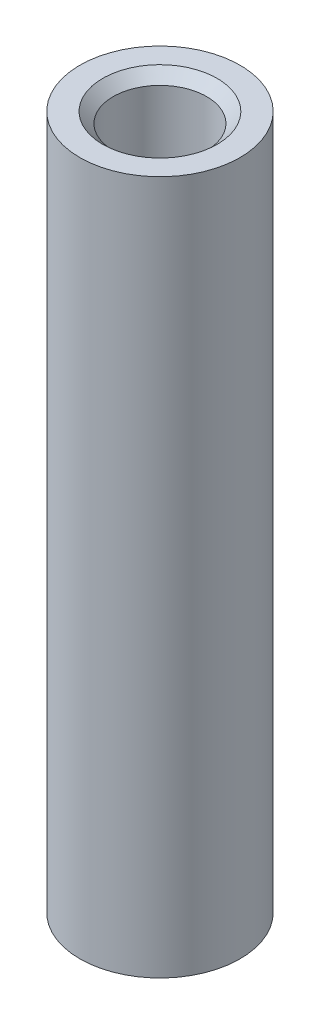
ISO-10303-21;
HEADER;
FILE_DESCRIPTION(('STEP AP214'),'2;1');
FILE_NAME('part.step','',(''),(''),'','','');
FILE_SCHEMA(('AUTOMOTIVE_DESIGN { 1 0 10303 214 1 1 1 1 }'));
ENDSEC;
DATA;
#1=APPLICATION_CONTEXT('core data for automotive mechanical design processes');
#2=APPLICATION_PROTOCOL_DEFINITION('international standard','automotive_design',2000,#1);
#3=PRODUCT_CONTEXT('',#1,'mechanical');
#4=PRODUCT('Part','Part','',(#3));
#5=PRODUCT_RELATED_PRODUCT_CATEGORY('part','',(#4));
#6=PRODUCT_DEFINITION_FORMATION('','',#4);
#7=PRODUCT_DEFINITION_CONTEXT('part definition',#1,'design');
#8=PRODUCT_DEFINITION('design','',#6,#7);
#9=PRODUCT_DEFINITION_SHAPE('','',#8);
#10=(LENGTH_UNIT() NAMED_UNIT(*) SI_UNIT(.MILLI.,.METRE.));
#11=(NAMED_UNIT(*) PLANE_ANGLE_UNIT() SI_UNIT($,.RADIAN.));
#12=(NAMED_UNIT(*) SI_UNIT($,.STERADIAN.) SOLID_ANGLE_UNIT());
#13=UNCERTAINTY_MEASURE_WITH_UNIT(LENGTH_MEASURE(1.E-05),#10,'distance_accuracy_value','');
#14=(GEOMETRIC_REPRESENTATION_CONTEXT(3) GLOBAL_UNCERTAINTY_ASSIGNED_CONTEXT((#13)) GLOBAL_UNIT_ASSIGNED_CONTEXT((#10,
#11,#12)) REPRESENTATION_CONTEXT('',''));
#15=CARTESIAN_POINT('',(0.,0.,0.));
#16=DIRECTION('',(0.,0.,1.));
#17=DIRECTION('',(1.,0.,0.));
#18=AXIS2_PLACEMENT_3D('',#15,#16,#17);
#19=CARTESIAN_POINT('',(0.,330.2,0.));
#20=DIRECTION('',(0.,1.,0.));
#21=DIRECTION('',(0.,0.,1.));
#22=AXIS2_PLACEMENT_3D('',#19,#20,#21);
#23=PLANE('',#22);
#24=CARTESIAN_POINT('',(0.,330.2,0.));
#25=DIRECTION('',(0.,1.,0.));
#26=DIRECTION('',(0.,0.,1.));
#27=AXIS2_PLACEMENT_3D('',#24,#25,#26);
#28=CIRCLE('',#27,27.2250000000001);
#29=CARTESIAN_POINT('',(0.,330.2,27.2250000000001));
#30=VERTEX_POINT('',#29);
#31=EDGE_CURVE('E10',#30,#30,#28,.F.);
#32=ORIENTED_EDGE('',*,*,#31,.T.);
#33=EDGE_LOOP('',(#32));
#34=FACE_BOUND('',#33,.T.);
#35=CARTESIAN_POINT('',(0.,330.2,0.));
#36=DIRECTION('',(0.,1.,0.));
#37=DIRECTION('',(0.,0.,1.));
#38=AXIS2_PLACEMENT_3D('',#35,#36,#37);
#39=CIRCLE('',#38,38.1);
#40=CARTESIAN_POINT('',(0.,330.2,38.1));
#41=VERTEX_POINT('',#40);
#42=EDGE_CURVE('E47',#41,#41,#39,.T.);
#43=ORIENTED_EDGE('',*,*,#42,.T.);
#44=EDGE_LOOP('',(#43));
#45=FACE_BOUND('',#44,.T.);
#46=ADVANCED_FACE('F35',(#34,#45),#23,.T.);
#47=CARTESIAN_POINT('',(0.,0.,0.));
#48=DIRECTION('',(0.,1.,0.));
#49=DIRECTION('',(0.,0.,1.));
#50=AXIS2_PLACEMENT_3D('',#47,#48,#49);
#51=PLANE('',#50);
#52=CARTESIAN_POINT('',(0.,0.,0.));
#53=DIRECTION('',(0.,1.,0.));
#54=DIRECTION('',(0.,0.,1.));
#55=AXIS2_PLACEMENT_3D('',#52,#53,#54);
#56=CIRCLE('',#55,38.1);
#57=CARTESIAN_POINT('',(0.,0.,38.1));
#58=VERTEX_POINT('',#57);
#59=EDGE_CURVE('E51',#58,#58,#56,.T.);
#60=ORIENTED_EDGE('',*,*,#59,.F.);
#61=EDGE_LOOP('',(#60));
#62=FACE_BOUND('',#61,.T.);
#63=CARTESIAN_POINT('',(0.,0.,0.));
#64=DIRECTION('',(0.,1.,0.));
#65=DIRECTION('',(0.,0.,1.));
#66=AXIS2_PLACEMENT_3D('',#63,#64,#65);
#67=CIRCLE('',#66,22.225);
#68=CARTESIAN_POINT('',(0.,0.,22.225));
#69=VERTEX_POINT('',#68);
#70=EDGE_CURVE('E55',#69,#69,#67,.T.);
#71=ORIENTED_EDGE('',*,*,#70,.T.);
#72=EDGE_LOOP('',(#71));
#73=FACE_BOUND('',#72,.T.);
#74=ADVANCED_FACE('F60',(#62,#73),#51,.F.);
#75=CARTESIAN_POINT('',(0.,330.2,0.));
#76=DIRECTION('',(0.,-1.,0.));
#77=DIRECTION('',(0.,0.,-1.));
#78=AXIS2_PLACEMENT_3D('',#75,#76,#77);
#79=CYLINDRICAL_SURFACE('',#78,38.1);
#80=ORIENTED_EDGE('',*,*,#42,.F.);
#81=EDGE_LOOP('',(#80));
#82=FACE_BOUND('',#81,.T.);
#83=ORIENTED_EDGE('',*,*,#59,.T.);
#84=EDGE_LOOP('',(#83));
#85=FACE_BOUND('',#84,.T.);
#86=ADVANCED_FACE('F64',(#82,#85),#79,.T.);
#87=CARTESIAN_POINT('',(0.,330.2,0.));
#88=DIRECTION('',(0.,-1.,0.));
#89=DIRECTION('',(0.,0.,-1.));
#90=AXIS2_PLACEMENT_3D('',#87,#88,#89);
#91=CYLINDRICAL_SURFACE('',#90,22.225);
#92=CARTESIAN_POINT('',(0.,325.2,0.));
#93=DIRECTION('',(0.,1.,0.));
#94=DIRECTION('',(0.,0.,1.));
#95=AXIS2_PLACEMENT_3D('',#92,#93,#94);
#96=CIRCLE('',#95,22.225);
#97=CARTESIAN_POINT('',(0.,325.2,22.225));
#98=VERTEX_POINT('',#97);
#99=EDGE_CURVE('E43',#98,#98,#96,.T.);
#100=ORIENTED_EDGE('',*,*,#99,.T.);
#101=EDGE_LOOP('',(#100));
#102=FACE_BOUND('',#101,.T.);
#103=ORIENTED_EDGE('',*,*,#70,.F.);
#104=EDGE_LOOP('',(#103));
#105=FACE_BOUND('',#104,.T.);
#106=ADVANCED_FACE('F62',(#102,#105),#91,.F.);
#107=CARTESIAN_POINT('',(0.,325.2,0.));
#108=DIRECTION('',(0.,1.,0.));
#109=DIRECTION('',(0.,0.,1.));
#110=AXIS2_PLACEMENT_3D('',#107,#108,#109);
#111=CONICAL_SURFACE('',#110,22.225,0.785398163397445);
#112=ORIENTED_EDGE('',*,*,#31,.F.);
#113=EDGE_LOOP('',(#112));
#114=FACE_BOUND('',#113,.T.);
#115=ORIENTED_EDGE('',*,*,#99,.F.);
#116=EDGE_LOOP('',(#115));
#117=FACE_BOUND('',#116,.T.);
#118=ADVANCED_FACE('F38',(#114,#117),#111,.F.);
#119=CLOSED_SHELL('',(#46,#74,#86,#106,#118));
#120=MANIFOLD_SOLID_BREP('B2',#119);
#121=ADVANCED_BREP_SHAPE_REPRESENTATION('',(#18,#120),#14);
#122=SHAPE_DEFINITION_REPRESENTATION(#9,#121);
ENDSEC;
END-ISO-10303-21;
